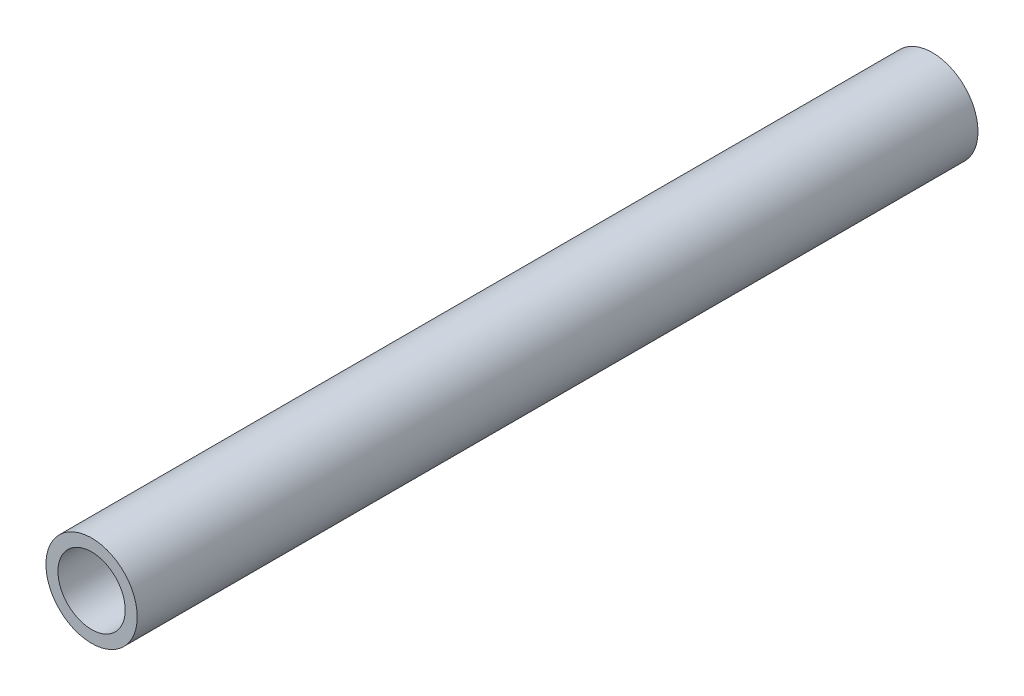
ISO-10303-21;
HEADER;
FILE_DESCRIPTION(('STEP AP214'),'2;1');
FILE_NAME('part.step','',(''),(''),'','','');
FILE_SCHEMA(('AUTOMOTIVE_DESIGN { 1 0 10303 214 1 1 1 1 }'));
ENDSEC;
DATA;
#1=APPLICATION_CONTEXT('core data for automotive mechanical design processes');
#2=APPLICATION_PROTOCOL_DEFINITION('international standard','automotive_design',2000,#1);
#3=PRODUCT_CONTEXT('',#1,'mechanical');
#4=PRODUCT('Part','Part','',(#3));
#5=PRODUCT_RELATED_PRODUCT_CATEGORY('part','',(#4));
#6=PRODUCT_DEFINITION_FORMATION('','',#4);
#7=PRODUCT_DEFINITION_CONTEXT('part definition',#1,'design');
#8=PRODUCT_DEFINITION('design','',#6,#7);
#9=PRODUCT_DEFINITION_SHAPE('','',#8);
#10=(LENGTH_UNIT() NAMED_UNIT(*) SI_UNIT(.MILLI.,.METRE.));
#11=(NAMED_UNIT(*) PLANE_ANGLE_UNIT() SI_UNIT($,.RADIAN.));
#12=(NAMED_UNIT(*) SI_UNIT($,.STERADIAN.) SOLID_ANGLE_UNIT());
#13=UNCERTAINTY_MEASURE_WITH_UNIT(LENGTH_MEASURE(1.E-05),#10,'distance_accuracy_value','');
#14=(GEOMETRIC_REPRESENTATION_CONTEXT(3) GLOBAL_UNCERTAINTY_ASSIGNED_CONTEXT((#13)) GLOBAL_UNIT_ASSIGNED_CONTEXT((#10,
#11,#12)) REPRESENTATION_CONTEXT('',''));
#15=CARTESIAN_POINT('',(0.,0.,0.));
#16=DIRECTION('',(0.,0.,1.));
#17=DIRECTION('',(1.,0.,0.));
#18=AXIS2_PLACEMENT_3D('',#15,#16,#17);
#19=CARTESIAN_POINT('',(0.,0.,88.8746));
#20=DIRECTION('',(0.,0.,1.));
#21=DIRECTION('',(1.,0.,0.));
#22=AXIS2_PLACEMENT_3D('',#19,#20,#21);
#23=PLANE('',#22);
#24=CARTESIAN_POINT('',(0.,0.,88.8746));
#25=DIRECTION('',(0.,0.,1.));
#26=DIRECTION('',(1.,0.,0.));
#27=AXIS2_PLACEMENT_3D('',#24,#25,#26);
#28=CIRCLE('',#27,4.826);
#29=CARTESIAN_POINT('',(4.826,0.,88.8746));
#30=VERTEX_POINT('',#29);
#31=EDGE_CURVE('E10',#30,#30,#28,.T.);
#32=ORIENTED_EDGE('',*,*,#31,.T.);
#33=EDGE_LOOP('',(#32));
#34=FACE_BOUND('',#33,.T.);
#35=CARTESIAN_POINT('',(0.,0.,88.8746));
#36=DIRECTION('',(0.,0.,1.));
#37=DIRECTION('',(1.,0.,0.));
#38=AXIS2_PLACEMENT_3D('',#35,#36,#37);
#39=CIRCLE('',#38,3.556);
#40=CARTESIAN_POINT('',(3.556,0.,88.8746));
#41=VERTEX_POINT('',#40);
#42=EDGE_CURVE('E42',#41,#41,#39,.T.);
#43=ORIENTED_EDGE('',*,*,#42,.F.);
#44=EDGE_LOOP('',(#43));
#45=FACE_BOUND('',#44,.T.);
#46=ADVANCED_FACE('F31',(#34,#45),#23,.T.);
#47=CARTESIAN_POINT('',(0.,0.,0.));
#48=DIRECTION('',(0.,0.,1.));
#49=DIRECTION('',(1.,0.,0.));
#50=AXIS2_PLACEMENT_3D('',#47,#48,#49);
#51=PLANE('',#50);
#52=CARTESIAN_POINT('',(0.,0.,0.));
#53=DIRECTION('',(0.,0.,1.));
#54=DIRECTION('',(1.,0.,0.));
#55=AXIS2_PLACEMENT_3D('',#52,#53,#54);
#56=CIRCLE('',#55,4.826);
#57=CARTESIAN_POINT('',(4.826,0.,0.));
#58=VERTEX_POINT('',#57);
#59=EDGE_CURVE('E35',#58,#58,#56,.T.);
#60=ORIENTED_EDGE('',*,*,#59,.F.);
#61=EDGE_LOOP('',(#60));
#62=FACE_BOUND('',#61,.T.);
#63=CARTESIAN_POINT('',(0.,0.,0.));
#64=DIRECTION('',(0.,0.,1.));
#65=DIRECTION('',(1.,0.,0.));
#66=AXIS2_PLACEMENT_3D('',#63,#64,#65);
#67=CIRCLE('',#66,3.556);
#68=CARTESIAN_POINT('',(3.556,0.,0.));
#69=VERTEX_POINT('',#68);
#70=EDGE_CURVE('E44',#69,#69,#67,.T.);
#71=ORIENTED_EDGE('',*,*,#70,.T.);
#72=EDGE_LOOP('',(#71));
#73=FACE_BOUND('',#72,.T.);
#74=ADVANCED_FACE('F54',(#62,#73),#51,.F.);
#75=CARTESIAN_POINT('',(0.,0.,88.8746));
#76=DIRECTION('',(0.,0.,-1.));
#77=DIRECTION('',(-1.,0.,0.));
#78=AXIS2_PLACEMENT_3D('',#75,#76,#77);
#79=CYLINDRICAL_SURFACE('',#78,4.826);
#80=ORIENTED_EDGE('',*,*,#31,.F.);
#81=EDGE_LOOP('',(#80));
#82=FACE_BOUND('',#81,.T.);
#83=ORIENTED_EDGE('',*,*,#59,.T.);
#84=EDGE_LOOP('',(#83));
#85=FACE_BOUND('',#84,.T.);
#86=ADVANCED_FACE('F33',(#82,#85),#79,.T.);
#87=CARTESIAN_POINT('',(0.,0.,88.8746));
#88=DIRECTION('',(0.,0.,-1.));
#89=DIRECTION('',(-1.,0.,0.));
#90=AXIS2_PLACEMENT_3D('',#87,#88,#89);
#91=CYLINDRICAL_SURFACE('',#90,3.556);
#92=ORIENTED_EDGE('',*,*,#42,.T.);
#93=EDGE_LOOP('',(#92));
#94=FACE_BOUND('',#93,.T.);
#95=ORIENTED_EDGE('',*,*,#70,.F.);
#96=EDGE_LOOP('',(#95));
#97=FACE_BOUND('',#96,.T.);
#98=ADVANCED_FACE('F50',(#94,#97),#91,.F.);
#99=CLOSED_SHELL('',(#46,#74,#86,#98));
#100=MANIFOLD_SOLID_BREP('B2',#99);
#101=ADVANCED_BREP_SHAPE_REPRESENTATION('',(#18,#100),#14);
#102=SHAPE_DEFINITION_REPRESENTATION(#9,#101);
ENDSEC;
END-ISO-10303-21;
